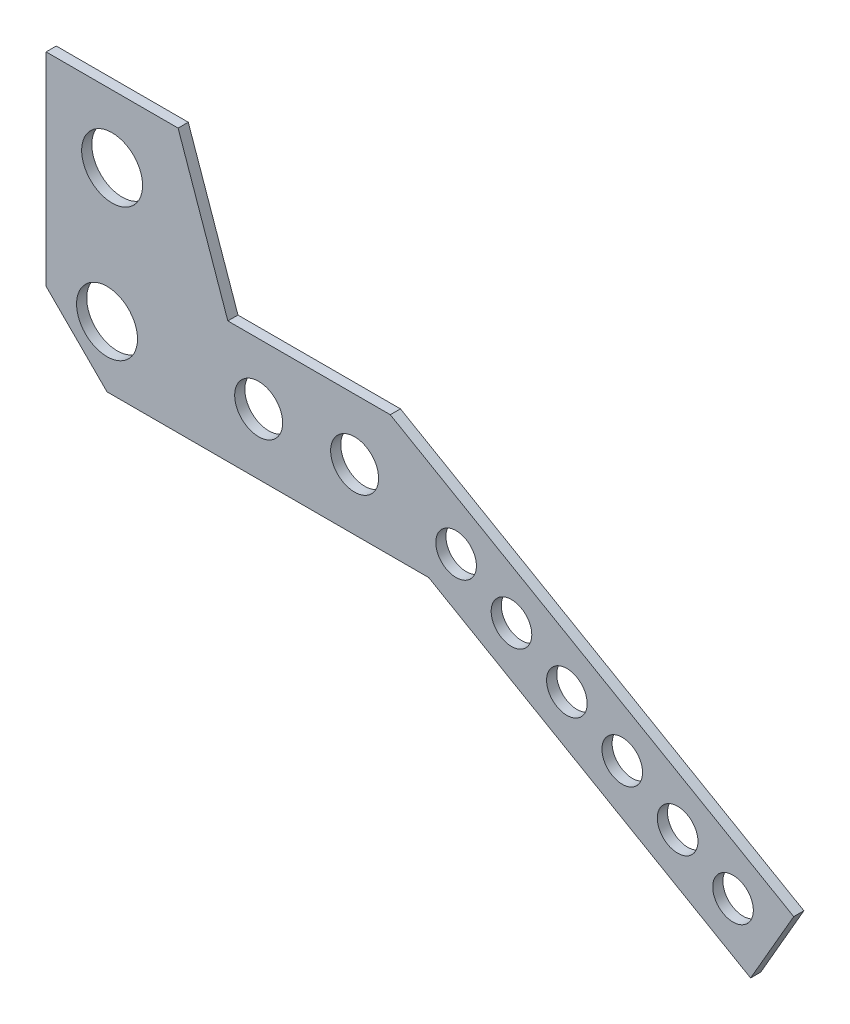
ISO-10303-21;
HEADER;
FILE_DESCRIPTION(('STEP AP214'),'2;1');
FILE_NAME('part.step','',(''),(''),'','','');
FILE_SCHEMA(('AUTOMOTIVE_DESIGN { 1 0 10303 214 1 1 1 1 }'));
ENDSEC;
DATA;
#1=APPLICATION_CONTEXT('core data for automotive mechanical design processes');
#2=APPLICATION_PROTOCOL_DEFINITION('international standard','automotive_design',2000,#1);
#3=PRODUCT_CONTEXT('',#1,'mechanical');
#4=PRODUCT('Part','Part','',(#3));
#5=PRODUCT_RELATED_PRODUCT_CATEGORY('part','',(#4));
#6=PRODUCT_DEFINITION_FORMATION('','',#4);
#7=PRODUCT_DEFINITION_CONTEXT('part definition',#1,'design');
#8=PRODUCT_DEFINITION('design','',#6,#7);
#9=PRODUCT_DEFINITION_SHAPE('','',#8);
#10=(LENGTH_UNIT() NAMED_UNIT(*) SI_UNIT(.MILLI.,.METRE.));
#11=(NAMED_UNIT(*) PLANE_ANGLE_UNIT() SI_UNIT($,.RADIAN.));
#12=(NAMED_UNIT(*) SI_UNIT($,.STERADIAN.) SOLID_ANGLE_UNIT());
#13=UNCERTAINTY_MEASURE_WITH_UNIT(LENGTH_MEASURE(1.E-05),#10,'distance_accuracy_value','');
#14=(GEOMETRIC_REPRESENTATION_CONTEXT(3) GLOBAL_UNCERTAINTY_ASSIGNED_CONTEXT((#13)) GLOBAL_UNIT_ASSIGNED_CONTEXT((#10,
#11,#12)) REPRESENTATION_CONTEXT('',''));
#15=CARTESIAN_POINT('',(0.,0.,0.));
#16=DIRECTION('',(0.,0.,1.));
#17=DIRECTION('',(1.,0.,0.));
#18=AXIS2_PLACEMENT_3D('',#15,#16,#17);
#19=CARTESIAN_POINT('',(0.,0.,3.175));
#20=DIRECTION('',(0.,0.,1.));
#21=DIRECTION('',(1.,0.,0.));
#22=AXIS2_PLACEMENT_3D('',#19,#20,#21);
#23=PLANE('',#22);
#24=CARTESIAN_POINT('',(0.,19.05,3.175));
#25=DIRECTION('',(0.,0.,1.));
#26=DIRECTION('',(1.,0.,0.));
#27=AXIS2_PLACEMENT_3D('',#24,#25,#26);
#28=CIRCLE('',#27,9.525);
#29=CARTESIAN_POINT('',(9.525,19.05,3.175));
#30=VERTEX_POINT('',#29);
#31=EDGE_CURVE('E243',#30,#30,#28,.T.);
#32=ORIENTED_EDGE('',*,*,#31,.F.);
#33=EDGE_LOOP('',(#32));
#34=FACE_BOUND('',#33,.T.);
#35=CARTESIAN_POINT('',(77.4154383788333,19.05,3.175));
#36=DIRECTION('',(0.,0.,1.));
#37=DIRECTION('',(1.,0.,0.));
#38=AXIS2_PLACEMENT_3D('',#35,#36,#37);
#39=CIRCLE('',#38,7.50000000000001);
#40=CARTESIAN_POINT('',(84.9154383788333,19.05,3.175));
#41=VERTEX_POINT('',#40);
#42=EDGE_CURVE('E231',#41,#41,#39,.T.);
#43=ORIENTED_EDGE('',*,*,#42,.F.);
#44=EDGE_LOOP('',(#43));
#45=FACE_BOUND('',#44,.T.);
#46=CARTESIAN_POINT('',(178.43316537104,-29.3604822485293,3.175));
#47=DIRECTION('',(0.,0.,1.));
#48=DIRECTION('',(1.,0.,0.));
#49=AXIS2_PLACEMENT_3D('',#46,#47,#48);
#50=CIRCLE('',#49,6.3499999999999);
#51=CARTESIAN_POINT('',(184.78316537104,-29.3604822485293,3.175));
#52=VERTEX_POINT('',#51);
#53=EDGE_CURVE('E219',#52,#52,#50,.T.);
#54=ORIENTED_EDGE('',*,*,#53,.F.);
#55=EDGE_LOOP('',(#54));
#56=FACE_BOUND('',#55,.T.);
#57=CARTESIAN_POINT('',(143.792149219662,-9.36048224852923,3.175));
#58=DIRECTION('',(0.,0.,1.));
#59=DIRECTION('',(1.,0.,0.));
#60=AXIS2_PLACEMENT_3D('',#57,#58,#59);
#61=CIRCLE('',#60,6.34999999999988);
#62=CARTESIAN_POINT('',(150.142149219662,-9.36048224852923,3.175));
#63=VERTEX_POINT('',#62);
#64=EDGE_CURVE('E207',#63,#63,#61,.T.);
#65=ORIENTED_EDGE('',*,*,#64,.F.);
#66=EDGE_LOOP('',(#65));
#67=FACE_BOUND('',#66,.T.);
#68=CARTESIAN_POINT('',(109.151133068285,10.6395177514708,3.175));
#69=DIRECTION('',(0.,0.,1.));
#70=DIRECTION('',(1.,0.,0.));
#71=AXIS2_PLACEMENT_3D('',#68,#69,#70);
#72=CIRCLE('',#71,6.34999999999972);
#73=CARTESIAN_POINT('',(115.501133068284,10.6395177514708,3.175));
#74=VERTEX_POINT('',#73);
#75=EDGE_CURVE('E143',#74,#74,#72,.T.);
#76=ORIENTED_EDGE('',*,*,#75,.F.);
#77=EDGE_LOOP('',(#76));
#78=FACE_BOUND('',#77,.T.);
#79=DIRECTION('',(0.707106781186546,-0.707106781186549,0.));
#80=VECTOR('',#79,1.);
#81=CARTESIAN_POINT('',(0.,0.,3.175));
#82=LINE('',#81,#80);
#83=CARTESIAN_POINT('',(-19.0499999999999,19.05,3.175));
#84=VERTEX_POINT('',#83);
#85=CARTESIAN_POINT('',(0.,0.,3.175));
#86=VERTEX_POINT('',#85);
#87=EDGE_CURVE('E156',#84,#86,#82,.T.);
#88=ORIENTED_EDGE('',*,*,#87,.T.);
#89=DIRECTION('',(1.,0.,0.));
#90=VECTOR('',#89,1.);
#91=CARTESIAN_POINT('',(100.591818381863,0.,3.175));
#92=LINE('',#91,#90);
#93=CARTESIAN_POINT('',(100.591818381863,0.,3.175));
#94=VERTEX_POINT('',#93);
#95=EDGE_CURVE('E99',#86,#94,#92,.T.);
#96=ORIENTED_EDGE('',*,*,#95,.T.);
#97=DIRECTION('',(0.866025403784438,-0.500000000000001,0.));
#98=VECTOR('',#97,1.);
#99=CARTESIAN_POINT('',(201.241315910283,-58.1100144918342,3.175));
#100=LINE('',#99,#98);
#101=CARTESIAN_POINT('',(201.241315910283,-58.1100144918342,3.175));
#102=VERTEX_POINT('',#101);
#103=EDGE_CURVE('E174',#94,#102,#100,.T.);
#104=ORIENTED_EDGE('',*,*,#103,.T.);
#105=DIRECTION('',(0.500000000000001,0.866025403784438,0.));
#106=VECTOR('',#105,1.);
#107=CARTESIAN_POINT('',(214.735065910283,-34.7381539072017,3.175));
#108=LINE('',#107,#106);
#109=CARTESIAN_POINT('',(214.735065910283,-34.7381539072017,3.175));
#110=VERTEX_POINT('',#109);
#111=EDGE_CURVE('E191',#102,#110,#108,.T.);
#112=ORIENTED_EDGE('',*,*,#111,.T.);
#113=DIRECTION('',(-0.866025403784438,0.500000000000001,0.));
#114=VECTOR('',#113,1.);
#115=CARTESIAN_POINT('',(88.5756826134889,38.1,3.175));
#116=LINE('',#115,#114);
#117=CARTESIAN_POINT('',(88.5756826134889,38.1,3.175));
#118=VERTEX_POINT('',#117);
#119=EDGE_CURVE('E190',#110,#118,#116,.T.);
#120=ORIENTED_EDGE('',*,*,#119,.T.);
#121=DIRECTION('',(-1.,0.,0.));
#122=VECTOR('',#121,1.);
#123=CARTESIAN_POINT('',(37.7756826134888,38.1,3.175));
#124=LINE('',#123,#122);
#125=CARTESIAN_POINT('',(37.7756826134888,38.1,3.175));
#126=VERTEX_POINT('',#125);
#127=EDGE_CURVE('E121',#118,#126,#124,.T.);
#128=ORIENTED_EDGE('',*,*,#127,.T.);
#129=DIRECTION('',(-0.330221452032412,0.943903486918872,0.));
#130=VECTOR('',#129,1.);
#131=CARTESIAN_POINT('',(22.2250000000001,82.55,3.175));
#132=LINE('',#131,#130);
#133=CARTESIAN_POINT('',(22.2250000000001,82.55,3.175));
#134=VERTEX_POINT('',#133);
#135=EDGE_CURVE('E115',#126,#134,#132,.T.);
#136=ORIENTED_EDGE('',*,*,#135,.T.);
#137=DIRECTION('',(-1.,0.,0.));
#138=VECTOR('',#137,1.);
#139=CARTESIAN_POINT('',(-19.0499999999999,82.55,3.175));
#140=LINE('',#139,#138);
#141=CARTESIAN_POINT('',(-19.0499999999999,82.55,3.175));
#142=VERTEX_POINT('',#141);
#143=EDGE_CURVE('E119',#134,#142,#140,.T.);
#144=ORIENTED_EDGE('',*,*,#143,.T.);
#145=DIRECTION('',(0.,-1.,0.));
#146=VECTOR('',#145,1.);
#147=CARTESIAN_POINT('',(-19.0499999999999,19.05,3.175));
#148=LINE('',#147,#146);
#149=EDGE_CURVE('E53',#142,#84,#148,.T.);
#150=ORIENTED_EDGE('',*,*,#149,.T.);
#151=EDGE_LOOP('',(#88,#96,#104,#112,#120,#128,#136,#144,#150));
#152=FACE_BOUND('',#151,.T.);
#153=CARTESIAN_POINT('',(126.471641143973,0.639517751470777,3.175));
#154=DIRECTION('',(0.,0.,1.));
#155=DIRECTION('',(1.,0.,0.));
#156=AXIS2_PLACEMENT_3D('',#153,#154,#155);
#157=CIRCLE('',#156,6.34999999999976);
#158=CARTESIAN_POINT('',(132.821641143973,0.639517751470777,3.175));
#159=VERTEX_POINT('',#158);
#160=EDGE_CURVE('E201',#159,#159,#157,.T.);
#161=ORIENTED_EDGE('',*,*,#160,.F.);
#162=EDGE_LOOP('',(#161));
#163=FACE_BOUND('',#162,.T.);
#164=CARTESIAN_POINT('',(161.112657295351,-19.3604822485293,3.175));
#165=DIRECTION('',(0.,0.,1.));
#166=DIRECTION('',(1.,0.,0.));
#167=AXIS2_PLACEMENT_3D('',#164,#165,#166);
#168=CIRCLE('',#167,6.34999999999991);
#169=CARTESIAN_POINT('',(167.462657295351,-19.3604822485293,3.175));
#170=VERTEX_POINT('',#169);
#171=EDGE_CURVE('E213',#170,#170,#168,.T.);
#172=ORIENTED_EDGE('',*,*,#171,.F.);
#173=EDGE_LOOP('',(#172));
#174=FACE_BOUND('',#173,.T.);
#175=CARTESIAN_POINT('',(195.753673446728,-39.3604822485293,3.175));
#176=DIRECTION('',(0.,0.,1.));
#177=DIRECTION('',(1.,0.,0.));
#178=AXIS2_PLACEMENT_3D('',#175,#176,#177);
#179=CIRCLE('',#178,6.35000000000002);
#180=CARTESIAN_POINT('',(202.103673446728,-39.3604822485293,3.175));
#181=VERTEX_POINT('',#180);
#182=EDGE_CURVE('E225',#181,#181,#179,.T.);
#183=ORIENTED_EDGE('',*,*,#182,.F.);
#184=EDGE_LOOP('',(#183));
#185=FACE_BOUND('',#184,.T.);
#186=CARTESIAN_POINT('',(47.4154383788334,19.05,3.175));
#187=DIRECTION('',(0.,0.,1.));
#188=DIRECTION('',(1.,0.,0.));
#189=AXIS2_PLACEMENT_3D('',#186,#187,#188);
#190=CIRCLE('',#189,7.5);
#191=CARTESIAN_POINT('',(54.9154383788334,19.05,3.175));
#192=VERTEX_POINT('',#191);
#193=EDGE_CURVE('E237',#192,#192,#190,.T.);
#194=ORIENTED_EDGE('',*,*,#193,.F.);
#195=EDGE_LOOP('',(#194));
#196=FACE_BOUND('',#195,.T.);
#197=CARTESIAN_POINT('',(1.58750000000009,61.4461951826789,3.175));
#198=DIRECTION('',(0.,0.,1.));
#199=DIRECTION('',(1.,0.,0.));
#200=AXIS2_PLACEMENT_3D('',#197,#198,#199);
#201=CIRCLE('',#200,9.525);
#202=CARTESIAN_POINT('',(11.1125000000001,61.4461951826789,3.175));
#203=VERTEX_POINT('',#202);
#204=EDGE_CURVE('E249',#203,#203,#201,.T.);
#205=ORIENTED_EDGE('',*,*,#204,.F.);
#206=EDGE_LOOP('',(#205));
#207=FACE_BOUND('',#206,.T.);
#208=ADVANCED_FACE('F36',(#34,#45,#56,#67,#78,#152,#163,#174,#185,#196,#207),#23,.T.);
#209=CARTESIAN_POINT('',(0.,0.,0.));
#210=DIRECTION('',(0.,0.,1.));
#211=DIRECTION('',(1.,0.,0.));
#212=AXIS2_PLACEMENT_3D('',#209,#210,#211);
#213=PLANE('',#212);
#214=DIRECTION('',(0.707106781186546,-0.707106781186549,0.));
#215=VECTOR('',#214,1.);
#216=CARTESIAN_POINT('',(0.,0.,0.));
#217=LINE('',#216,#215);
#218=CARTESIAN_POINT('',(-19.0499999999999,19.05,0.));
#219=VERTEX_POINT('',#218);
#220=CARTESIAN_POINT('',(0.,0.,0.));
#221=VERTEX_POINT('',#220);
#222=EDGE_CURVE('E139',#219,#221,#217,.T.);
#223=ORIENTED_EDGE('',*,*,#222,.F.);
#224=DIRECTION('',(0.,-1.,0.));
#225=VECTOR('',#224,1.);
#226=CARTESIAN_POINT('',(-19.0499999999999,19.05,0.));
#227=LINE('',#226,#225);
#228=CARTESIAN_POINT('',(-19.0499999999999,82.55,0.));
#229=VERTEX_POINT('',#228);
#230=EDGE_CURVE('E91',#229,#219,#227,.T.);
#231=ORIENTED_EDGE('',*,*,#230,.F.);
#232=DIRECTION('',(-1.,0.,0.));
#233=VECTOR('',#232,1.);
#234=CARTESIAN_POINT('',(-19.0499999999999,82.55,0.));
#235=LINE('',#234,#233);
#236=CARTESIAN_POINT('',(22.2250000000001,82.55,0.));
#237=VERTEX_POINT('',#236);
#238=EDGE_CURVE('E85',#237,#229,#235,.T.);
#239=ORIENTED_EDGE('',*,*,#238,.F.);
#240=DIRECTION('',(-0.330221452032412,0.943903486918872,0.));
#241=VECTOR('',#240,1.);
#242=CARTESIAN_POINT('',(22.2250000000001,82.55,0.));
#243=LINE('',#242,#241);
#244=CARTESIAN_POINT('',(37.7756826134888,38.1,0.));
#245=VERTEX_POINT('',#244);
#246=EDGE_CURVE('E129',#245,#237,#243,.T.);
#247=ORIENTED_EDGE('',*,*,#246,.F.);
#248=DIRECTION('',(-1.,0.,0.));
#249=VECTOR('',#248,1.);
#250=CARTESIAN_POINT('',(37.7756826134888,38.1,0.));
#251=LINE('',#250,#249);
#252=CARTESIAN_POINT('',(88.5756826134889,38.1,0.));
#253=VERTEX_POINT('',#252);
#254=EDGE_CURVE('E151',#253,#245,#251,.T.);
#255=ORIENTED_EDGE('',*,*,#254,.F.);
#256=DIRECTION('',(-0.866025403784438,0.500000000000001,0.));
#257=VECTOR('',#256,1.);
#258=CARTESIAN_POINT('',(88.5756826134889,38.1,0.));
#259=LINE('',#258,#257);
#260=CARTESIAN_POINT('',(214.735065910283,-34.7381539072017,0.));
#261=VERTEX_POINT('',#260);
#262=EDGE_CURVE('E149',#261,#253,#259,.T.);
#263=ORIENTED_EDGE('',*,*,#262,.F.);
#264=DIRECTION('',(0.500000000000001,0.866025403784438,0.));
#265=VECTOR('',#264,1.);
#266=CARTESIAN_POINT('',(214.735065910283,-34.7381539072017,0.));
#267=LINE('',#266,#265);
#268=CARTESIAN_POINT('',(201.241315910283,-58.1100144918342,0.));
#269=VERTEX_POINT('',#268);
#270=EDGE_CURVE('E147',#269,#261,#267,.T.);
#271=ORIENTED_EDGE('',*,*,#270,.F.);
#272=DIRECTION('',(0.866025403784438,-0.500000000000001,0.));
#273=VECTOR('',#272,1.);
#274=CARTESIAN_POINT('',(201.241315910283,-58.1100144918342,0.));
#275=LINE('',#274,#273);
#276=CARTESIAN_POINT('',(100.591818381863,0.,0.));
#277=VERTEX_POINT('',#276);
#278=EDGE_CURVE('E145',#277,#269,#275,.T.);
#279=ORIENTED_EDGE('',*,*,#278,.F.);
#280=DIRECTION('',(1.,0.,0.));
#281=VECTOR('',#280,1.);
#282=CARTESIAN_POINT('',(100.591818381863,0.,0.));
#283=LINE('',#282,#281);
#284=EDGE_CURVE('E142',#221,#277,#283,.T.);
#285=ORIENTED_EDGE('',*,*,#284,.F.);
#286=EDGE_LOOP('',(#223,#231,#239,#247,#255,#263,#271,#279,#285));
#287=FACE_BOUND('',#286,.T.);
#288=CARTESIAN_POINT('',(109.151133068285,10.6395177514708,0.));
#289=DIRECTION('',(0.,0.,1.));
#290=DIRECTION('',(1.,0.,0.));
#291=AXIS2_PLACEMENT_3D('',#288,#289,#290);
#292=CIRCLE('',#291,6.34999999999972);
#293=CARTESIAN_POINT('',(115.501133068284,10.6395177514708,0.));
#294=VERTEX_POINT('',#293);
#295=EDGE_CURVE('E198',#294,#294,#292,.T.);
#296=ORIENTED_EDGE('',*,*,#295,.T.);
#297=EDGE_LOOP('',(#296));
#298=FACE_BOUND('',#297,.T.);
#299=CARTESIAN_POINT('',(126.471641143973,0.639517751470777,0.));
#300=DIRECTION('',(0.,0.,1.));
#301=DIRECTION('',(1.,0.,0.));
#302=AXIS2_PLACEMENT_3D('',#299,#300,#301);
#303=CIRCLE('',#302,6.34999999999976);
#304=CARTESIAN_POINT('',(132.821641143973,0.639517751470777,0.));
#305=VERTEX_POINT('',#304);
#306=EDGE_CURVE('E204',#305,#305,#303,.T.);
#307=ORIENTED_EDGE('',*,*,#306,.T.);
#308=EDGE_LOOP('',(#307));
#309=FACE_BOUND('',#308,.T.);
#310=CARTESIAN_POINT('',(143.792149219662,-9.36048224852923,0.));
#311=DIRECTION('',(0.,0.,1.));
#312=DIRECTION('',(1.,0.,0.));
#313=AXIS2_PLACEMENT_3D('',#310,#311,#312);
#314=CIRCLE('',#313,6.34999999999988);
#315=CARTESIAN_POINT('',(150.142149219662,-9.36048224852923,0.));
#316=VERTEX_POINT('',#315);
#317=EDGE_CURVE('E210',#316,#316,#314,.T.);
#318=ORIENTED_EDGE('',*,*,#317,.T.);
#319=EDGE_LOOP('',(#318));
#320=FACE_BOUND('',#319,.T.);
#321=CARTESIAN_POINT('',(161.112657295351,-19.3604822485293,0.));
#322=DIRECTION('',(0.,0.,1.));
#323=DIRECTION('',(1.,0.,0.));
#324=AXIS2_PLACEMENT_3D('',#321,#322,#323);
#325=CIRCLE('',#324,6.34999999999991);
#326=CARTESIAN_POINT('',(167.462657295351,-19.3604822485293,0.));
#327=VERTEX_POINT('',#326);
#328=EDGE_CURVE('E216',#327,#327,#325,.T.);
#329=ORIENTED_EDGE('',*,*,#328,.T.);
#330=EDGE_LOOP('',(#329));
#331=FACE_BOUND('',#330,.T.);
#332=CARTESIAN_POINT('',(178.43316537104,-29.3604822485293,0.));
#333=DIRECTION('',(0.,0.,1.));
#334=DIRECTION('',(1.,0.,0.));
#335=AXIS2_PLACEMENT_3D('',#332,#333,#334);
#336=CIRCLE('',#335,6.3499999999999);
#337=CARTESIAN_POINT('',(184.78316537104,-29.3604822485293,0.));
#338=VERTEX_POINT('',#337);
#339=EDGE_CURVE('E222',#338,#338,#336,.T.);
#340=ORIENTED_EDGE('',*,*,#339,.T.);
#341=EDGE_LOOP('',(#340));
#342=FACE_BOUND('',#341,.T.);
#343=CARTESIAN_POINT('',(195.753673446728,-39.3604822485293,0.));
#344=DIRECTION('',(0.,0.,1.));
#345=DIRECTION('',(1.,0.,0.));
#346=AXIS2_PLACEMENT_3D('',#343,#344,#345);
#347=CIRCLE('',#346,6.35000000000002);
#348=CARTESIAN_POINT('',(202.103673446728,-39.3604822485293,0.));
#349=VERTEX_POINT('',#348);
#350=EDGE_CURVE('E228',#349,#349,#347,.T.);
#351=ORIENTED_EDGE('',*,*,#350,.T.);
#352=EDGE_LOOP('',(#351));
#353=FACE_BOUND('',#352,.T.);
#354=CARTESIAN_POINT('',(77.4154383788333,19.05,0.));
#355=DIRECTION('',(0.,0.,1.));
#356=DIRECTION('',(1.,0.,0.));
#357=AXIS2_PLACEMENT_3D('',#354,#355,#356);
#358=CIRCLE('',#357,7.50000000000001);
#359=CARTESIAN_POINT('',(84.9154383788333,19.05,0.));
#360=VERTEX_POINT('',#359);
#361=EDGE_CURVE('E234',#360,#360,#358,.T.);
#362=ORIENTED_EDGE('',*,*,#361,.T.);
#363=EDGE_LOOP('',(#362));
#364=FACE_BOUND('',#363,.T.);
#365=CARTESIAN_POINT('',(47.4154383788334,19.05,0.));
#366=DIRECTION('',(0.,0.,1.));
#367=DIRECTION('',(1.,0.,0.));
#368=AXIS2_PLACEMENT_3D('',#365,#366,#367);
#369=CIRCLE('',#368,7.5);
#370=CARTESIAN_POINT('',(54.9154383788334,19.05,0.));
#371=VERTEX_POINT('',#370);
#372=EDGE_CURVE('E240',#371,#371,#369,.T.);
#373=ORIENTED_EDGE('',*,*,#372,.T.);
#374=EDGE_LOOP('',(#373));
#375=FACE_BOUND('',#374,.T.);
#376=CARTESIAN_POINT('',(0.,19.05,0.));
#377=DIRECTION('',(0.,0.,1.));
#378=DIRECTION('',(1.,0.,0.));
#379=AXIS2_PLACEMENT_3D('',#376,#377,#378);
#380=CIRCLE('',#379,9.525);
#381=CARTESIAN_POINT('',(9.525,19.05,0.));
#382=VERTEX_POINT('',#381);
#383=EDGE_CURVE('E246',#382,#382,#380,.T.);
#384=ORIENTED_EDGE('',*,*,#383,.T.);
#385=EDGE_LOOP('',(#384));
#386=FACE_BOUND('',#385,.T.);
#387=CARTESIAN_POINT('',(1.58750000000009,61.4461951826789,0.));
#388=DIRECTION('',(0.,0.,1.));
#389=DIRECTION('',(1.,0.,0.));
#390=AXIS2_PLACEMENT_3D('',#387,#388,#389);
#391=CIRCLE('',#390,9.525);
#392=CARTESIAN_POINT('',(11.1125000000001,61.4461951826789,0.));
#393=VERTEX_POINT('',#392);
#394=EDGE_CURVE('E252',#393,#393,#391,.T.);
#395=ORIENTED_EDGE('',*,*,#394,.T.);
#396=EDGE_LOOP('',(#395));
#397=FACE_BOUND('',#396,.T.);
#398=ADVANCED_FACE('F178',(#287,#298,#309,#320,#331,#342,#353,#364,#375,#386,#397),#213,.F.);
#399=CARTESIAN_POINT('',(0.,0.,3.175));
#400=DIRECTION('',(0.707106781186549,0.707106781186546,0.));
#401=DIRECTION('',(-0.707106781186546,0.707106781186549,0.));
#402=AXIS2_PLACEMENT_3D('',#399,#400,#401);
#403=PLANE('',#402);
#404=ORIENTED_EDGE('',*,*,#222,.T.);
#405=DIRECTION('',(0.,0.,-1.));
#406=VECTOR('',#405,1.);
#407=CARTESIAN_POINT('',(0.,0.,3.175));
#408=LINE('',#407,#406);
#409=EDGE_CURVE('E11',#86,#221,#408,.T.);
#410=ORIENTED_EDGE('',*,*,#409,.F.);
#411=ORIENTED_EDGE('',*,*,#87,.F.);
#412=DIRECTION('',(0.,0.,-1.));
#413=VECTOR('',#412,1.);
#414=CARTESIAN_POINT('',(-19.0499999999999,19.05,3.175));
#415=LINE('',#414,#413);
#416=EDGE_CURVE('E135',#84,#219,#415,.T.);
#417=ORIENTED_EDGE('',*,*,#416,.T.);
#418=EDGE_LOOP('',(#404,#410,#411,#417));
#419=FACE_BOUND('',#418,.T.);
#420=ADVANCED_FACE('F38',(#419),#403,.F.);
#421=CARTESIAN_POINT('',(100.591818381863,0.,3.175));
#422=DIRECTION('',(0.,1.,0.));
#423=DIRECTION('',(0.,0.,1.));
#424=AXIS2_PLACEMENT_3D('',#421,#422,#423);
#425=PLANE('',#424);
#426=ORIENTED_EDGE('',*,*,#284,.T.);
#427=DIRECTION('',(0.,0.,-1.));
#428=VECTOR('',#427,1.);
#429=CARTESIAN_POINT('',(100.591818381863,0.,3.175));
#430=LINE('',#429,#428);
#431=EDGE_CURVE('E45',#94,#277,#430,.T.);
#432=ORIENTED_EDGE('',*,*,#431,.F.);
#433=ORIENTED_EDGE('',*,*,#95,.F.);
#434=ORIENTED_EDGE('',*,*,#409,.T.);
#435=EDGE_LOOP('',(#426,#432,#433,#434));
#436=FACE_BOUND('',#435,.T.);
#437=ADVANCED_FACE('F290',(#436),#425,.F.);
#438=CARTESIAN_POINT('',(201.241315910283,-58.1100144918342,3.175));
#439=DIRECTION('',(0.500000000000001,0.866025403784438,0.));
#440=DIRECTION('',(-0.866025403784438,0.500000000000001,0.));
#441=AXIS2_PLACEMENT_3D('',#438,#439,#440);
#442=PLANE('',#441);
#443=ORIENTED_EDGE('',*,*,#278,.T.);
#444=DIRECTION('',(0.,0.,-1.));
#445=VECTOR('',#444,1.);
#446=CARTESIAN_POINT('',(201.241315910283,-58.1100144918342,3.175));
#447=LINE('',#446,#445);
#448=EDGE_CURVE('E166',#102,#269,#447,.T.);
#449=ORIENTED_EDGE('',*,*,#448,.F.);
#450=ORIENTED_EDGE('',*,*,#103,.F.);
#451=ORIENTED_EDGE('',*,*,#431,.T.);
#452=EDGE_LOOP('',(#443,#449,#450,#451));
#453=FACE_BOUND('',#452,.T.);
#454=ADVANCED_FACE('F172',(#453),#442,.F.);
#455=CARTESIAN_POINT('',(214.735065910283,-34.7381539072017,3.175));
#456=DIRECTION('',(-0.866025403784438,0.500000000000001,0.));
#457=DIRECTION('',(-0.500000000000001,-0.866025403784438,0.));
#458=AXIS2_PLACEMENT_3D('',#455,#456,#457);
#459=PLANE('',#458);
#460=ORIENTED_EDGE('',*,*,#270,.T.);
#461=DIRECTION('',(0.,0.,-1.));
#462=VECTOR('',#461,1.);
#463=CARTESIAN_POINT('',(214.735065910283,-34.7381539072017,3.175));
#464=LINE('',#463,#462);
#465=EDGE_CURVE('E163',#110,#261,#464,.T.);
#466=ORIENTED_EDGE('',*,*,#465,.F.);
#467=ORIENTED_EDGE('',*,*,#111,.F.);
#468=ORIENTED_EDGE('',*,*,#448,.T.);
#469=EDGE_LOOP('',(#460,#466,#467,#468));
#470=FACE_BOUND('',#469,.T.);
#471=ADVANCED_FACE('F184',(#470),#459,.F.);
#472=CARTESIAN_POINT('',(88.5756826134889,38.1,3.175));
#473=DIRECTION('',(-0.500000000000001,-0.866025403784438,0.));
#474=DIRECTION('',(0.866025403784438,-0.500000000000001,0.));
#475=AXIS2_PLACEMENT_3D('',#472,#473,#474);
#476=PLANE('',#475);
#477=ORIENTED_EDGE('',*,*,#262,.T.);
#478=DIRECTION('',(0.,0.,-1.));
#479=VECTOR('',#478,1.);
#480=CARTESIAN_POINT('',(88.5756826134889,38.1,3.175));
#481=LINE('',#480,#479);
#482=EDGE_CURVE('E160',#118,#253,#481,.T.);
#483=ORIENTED_EDGE('',*,*,#482,.F.);
#484=ORIENTED_EDGE('',*,*,#119,.F.);
#485=ORIENTED_EDGE('',*,*,#465,.T.);
#486=EDGE_LOOP('',(#477,#483,#484,#485));
#487=FACE_BOUND('',#486,.T.);
#488=ADVANCED_FACE('F188',(#487),#476,.F.);
#489=CARTESIAN_POINT('',(37.7756826134888,38.1,3.175));
#490=DIRECTION('',(0.,-1.,0.));
#491=DIRECTION('',(0.,0.,-1.));
#492=AXIS2_PLACEMENT_3D('',#489,#490,#491);
#493=PLANE('',#492);
#494=ORIENTED_EDGE('',*,*,#254,.T.);
#495=DIRECTION('',(0.,0.,-1.));
#496=VECTOR('',#495,1.);
#497=CARTESIAN_POINT('',(37.7756826134888,38.1,3.175));
#498=LINE('',#497,#496);
#499=EDGE_CURVE('E130',#126,#245,#498,.T.);
#500=ORIENTED_EDGE('',*,*,#499,.F.);
#501=ORIENTED_EDGE('',*,*,#127,.F.);
#502=ORIENTED_EDGE('',*,*,#482,.T.);
#503=EDGE_LOOP('',(#494,#500,#501,#502));
#504=FACE_BOUND('',#503,.T.);
#505=ADVANCED_FACE('F281',(#504),#493,.F.);
#506=CARTESIAN_POINT('',(22.2250000000001,82.55,3.175));
#507=DIRECTION('',(-0.943903486918872,-0.330221452032412,0.));
#508=DIRECTION('',(0.330221452032412,-0.943903486918872,0.));
#509=AXIS2_PLACEMENT_3D('',#506,#507,#508);
#510=PLANE('',#509);
#511=ORIENTED_EDGE('',*,*,#246,.T.);
#512=DIRECTION('',(0.,0.,-1.));
#513=VECTOR('',#512,1.);
#514=CARTESIAN_POINT('',(22.2250000000001,82.55,3.175));
#515=LINE('',#514,#513);
#516=EDGE_CURVE('E126',#134,#237,#515,.T.);
#517=ORIENTED_EDGE('',*,*,#516,.F.);
#518=ORIENTED_EDGE('',*,*,#135,.F.);
#519=ORIENTED_EDGE('',*,*,#499,.T.);
#520=EDGE_LOOP('',(#511,#517,#518,#519));
#521=FACE_BOUND('',#520,.T.);
#522=ADVANCED_FACE('F127',(#521),#510,.F.);
#523=CARTESIAN_POINT('',(-19.0499999999999,82.55,3.175));
#524=DIRECTION('',(0.,-1.,0.));
#525=DIRECTION('',(0.,0.,-1.));
#526=AXIS2_PLACEMENT_3D('',#523,#524,#525);
#527=PLANE('',#526);
#528=ORIENTED_EDGE('',*,*,#238,.T.);
#529=DIRECTION('',(0.,0.,-1.));
#530=VECTOR('',#529,1.);
#531=CARTESIAN_POINT('',(-19.0499999999999,82.55,3.175));
#532=LINE('',#531,#530);
#533=EDGE_CURVE('E131',#142,#229,#532,.T.);
#534=ORIENTED_EDGE('',*,*,#533,.F.);
#535=ORIENTED_EDGE('',*,*,#143,.F.);
#536=ORIENTED_EDGE('',*,*,#516,.T.);
#537=EDGE_LOOP('',(#528,#534,#535,#536));
#538=FACE_BOUND('',#537,.T.);
#539=ADVANCED_FACE('F133',(#538),#527,.F.);
#540=CARTESIAN_POINT('',(-19.0499999999999,19.05,3.175));
#541=DIRECTION('',(1.,0.,0.));
#542=DIRECTION('',(0.,0.,-1.));
#543=AXIS2_PLACEMENT_3D('',#540,#541,#542);
#544=PLANE('',#543);
#545=ORIENTED_EDGE('',*,*,#230,.T.);
#546=ORIENTED_EDGE('',*,*,#416,.F.);
#547=ORIENTED_EDGE('',*,*,#149,.F.);
#548=ORIENTED_EDGE('',*,*,#533,.T.);
#549=EDGE_LOOP('',(#545,#546,#547,#548));
#550=FACE_BOUND('',#549,.T.);
#551=ADVANCED_FACE('F274',(#550),#544,.F.);
#552=CARTESIAN_POINT('',(109.151133068285,10.6395177514708,3.175));
#553=DIRECTION('',(0.,0.,-1.));
#554=DIRECTION('',(-1.,0.,0.));
#555=AXIS2_PLACEMENT_3D('',#552,#553,#554);
#556=CYLINDRICAL_SURFACE('',#555,6.34999999999972);
#557=ORIENTED_EDGE('',*,*,#75,.T.);
#558=EDGE_LOOP('',(#557));
#559=FACE_BOUND('',#558,.T.);
#560=ORIENTED_EDGE('',*,*,#295,.F.);
#561=EDGE_LOOP('',(#560));
#562=FACE_BOUND('',#561,.T.);
#563=ADVANCED_FACE('F271',(#559,#562),#556,.F.);
#564=CARTESIAN_POINT('',(126.471641143973,0.639517751470777,3.175));
#565=DIRECTION('',(0.,0.,-1.));
#566=DIRECTION('',(-1.,0.,0.));
#567=AXIS2_PLACEMENT_3D('',#564,#565,#566);
#568=CYLINDRICAL_SURFACE('',#567,6.34999999999976);
#569=ORIENTED_EDGE('',*,*,#160,.T.);
#570=EDGE_LOOP('',(#569));
#571=FACE_BOUND('',#570,.T.);
#572=ORIENTED_EDGE('',*,*,#306,.F.);
#573=EDGE_LOOP('',(#572));
#574=FACE_BOUND('',#573,.T.);
#575=ADVANCED_FACE('F372',(#571,#574),#568,.F.);
#576=CARTESIAN_POINT('',(143.792149219662,-9.36048224852923,3.175));
#577=DIRECTION('',(0.,0.,-1.));
#578=DIRECTION('',(-1.,0.,0.));
#579=AXIS2_PLACEMENT_3D('',#576,#577,#578);
#580=CYLINDRICAL_SURFACE('',#579,6.34999999999988);
#581=ORIENTED_EDGE('',*,*,#64,.T.);
#582=EDGE_LOOP('',(#581));
#583=FACE_BOUND('',#582,.T.);
#584=ORIENTED_EDGE('',*,*,#317,.F.);
#585=EDGE_LOOP('',(#584));
#586=FACE_BOUND('',#585,.T.);
#587=ADVANCED_FACE('F381',(#583,#586),#580,.F.);
#588=CARTESIAN_POINT('',(161.112657295351,-19.3604822485293,3.175));
#589=DIRECTION('',(0.,0.,-1.));
#590=DIRECTION('',(-1.,0.,0.));
#591=AXIS2_PLACEMENT_3D('',#588,#589,#590);
#592=CYLINDRICAL_SURFACE('',#591,6.34999999999991);
#593=ORIENTED_EDGE('',*,*,#171,.T.);
#594=EDGE_LOOP('',(#593));
#595=FACE_BOUND('',#594,.T.);
#596=ORIENTED_EDGE('',*,*,#328,.F.);
#597=EDGE_LOOP('',(#596));
#598=FACE_BOUND('',#597,.T.);
#599=ADVANCED_FACE('F390',(#595,#598),#592,.F.);
#600=CARTESIAN_POINT('',(178.43316537104,-29.3604822485293,3.175));
#601=DIRECTION('',(0.,0.,-1.));
#602=DIRECTION('',(-1.,0.,0.));
#603=AXIS2_PLACEMENT_3D('',#600,#601,#602);
#604=CYLINDRICAL_SURFACE('',#603,6.3499999999999);
#605=ORIENTED_EDGE('',*,*,#53,.T.);
#606=EDGE_LOOP('',(#605));
#607=FACE_BOUND('',#606,.T.);
#608=ORIENTED_EDGE('',*,*,#339,.F.);
#609=EDGE_LOOP('',(#608));
#610=FACE_BOUND('',#609,.T.);
#611=ADVANCED_FACE('F400',(#607,#610),#604,.F.);
#612=CARTESIAN_POINT('',(195.753673446728,-39.3604822485293,3.175));
#613=DIRECTION('',(0.,0.,-1.));
#614=DIRECTION('',(-1.,0.,0.));
#615=AXIS2_PLACEMENT_3D('',#612,#613,#614);
#616=CYLINDRICAL_SURFACE('',#615,6.35000000000002);
#617=ORIENTED_EDGE('',*,*,#182,.T.);
#618=EDGE_LOOP('',(#617));
#619=FACE_BOUND('',#618,.T.);
#620=ORIENTED_EDGE('',*,*,#350,.F.);
#621=EDGE_LOOP('',(#620));
#622=FACE_BOUND('',#621,.T.);
#623=ADVANCED_FACE('F410',(#619,#622),#616,.F.);
#624=CARTESIAN_POINT('',(77.4154383788333,19.05,3.175));
#625=DIRECTION('',(0.,0.,-1.));
#626=DIRECTION('',(-1.,0.,0.));
#627=AXIS2_PLACEMENT_3D('',#624,#625,#626);
#628=CYLINDRICAL_SURFACE('',#627,7.50000000000001);
#629=ORIENTED_EDGE('',*,*,#42,.T.);
#630=EDGE_LOOP('',(#629));
#631=FACE_BOUND('',#630,.T.);
#632=ORIENTED_EDGE('',*,*,#361,.F.);
#633=EDGE_LOOP('',(#632));
#634=FACE_BOUND('',#633,.T.);
#635=ADVANCED_FACE('F420',(#631,#634),#628,.F.);
#636=CARTESIAN_POINT('',(47.4154383788334,19.05,3.175));
#637=DIRECTION('',(0.,0.,-1.));
#638=DIRECTION('',(-1.,0.,0.));
#639=AXIS2_PLACEMENT_3D('',#636,#637,#638);
#640=CYLINDRICAL_SURFACE('',#639,7.5);
#641=ORIENTED_EDGE('',*,*,#193,.T.);
#642=EDGE_LOOP('',(#641));
#643=FACE_BOUND('',#642,.T.);
#644=ORIENTED_EDGE('',*,*,#372,.F.);
#645=EDGE_LOOP('',(#644));
#646=FACE_BOUND('',#645,.T.);
#647=ADVANCED_FACE('F430',(#643,#646),#640,.F.);
#648=CARTESIAN_POINT('',(0.,19.05,3.175));
#649=DIRECTION('',(0.,0.,-1.));
#650=DIRECTION('',(-1.,0.,0.));
#651=AXIS2_PLACEMENT_3D('',#648,#649,#650);
#652=CYLINDRICAL_SURFACE('',#651,9.525);
#653=ORIENTED_EDGE('',*,*,#31,.T.);
#654=EDGE_LOOP('',(#653));
#655=FACE_BOUND('',#654,.T.);
#656=ORIENTED_EDGE('',*,*,#383,.F.);
#657=EDGE_LOOP('',(#656));
#658=FACE_BOUND('',#657,.T.);
#659=ADVANCED_FACE('F440',(#655,#658),#652,.F.);
#660=CARTESIAN_POINT('',(1.58750000000009,61.4461951826789,3.175));
#661=DIRECTION('',(0.,0.,-1.));
#662=DIRECTION('',(-1.,0.,0.));
#663=AXIS2_PLACEMENT_3D('',#660,#661,#662);
#664=CYLINDRICAL_SURFACE('',#663,9.525);
#665=ORIENTED_EDGE('',*,*,#204,.T.);
#666=EDGE_LOOP('',(#665));
#667=FACE_BOUND('',#666,.T.);
#668=ORIENTED_EDGE('',*,*,#394,.F.);
#669=EDGE_LOOP('',(#668));
#670=FACE_BOUND('',#669,.T.);
#671=ADVANCED_FACE('F258',(#667,#670),#664,.F.);
#672=CLOSED_SHELL('',(#208,#398,#420,#437,#454,#471,#488,#505,#522,#539,#551,#563,#575,#587,
#599,#611,#623,#635,#647,#659,#671));
#673=MANIFOLD_SOLID_BREP('B2',#672);
#674=ADVANCED_BREP_SHAPE_REPRESENTATION('',(#18,#673),#14);
#675=SHAPE_DEFINITION_REPRESENTATION(#9,#674);
ENDSEC;
END-ISO-10303-21;
